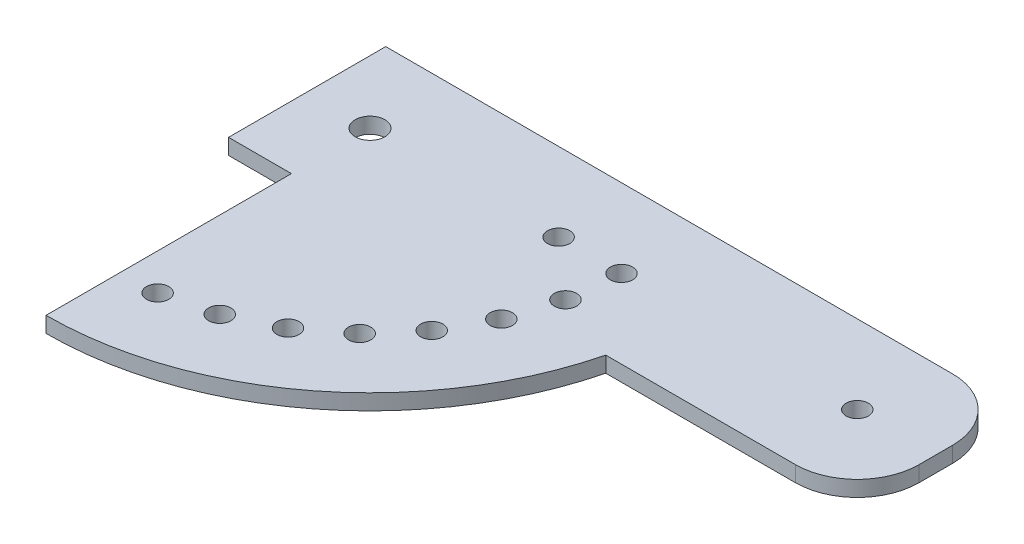
ISO-10303-21;
HEADER;
FILE_DESCRIPTION(('STEP AP214'),'2;1');
FILE_NAME('part.step','',(''),(''),'','','');
FILE_SCHEMA(('AUTOMOTIVE_DESIGN { 1 0 10303 214 1 1 1 1 }'));
ENDSEC;
DATA;
#1=APPLICATION_CONTEXT('core data for automotive mechanical design processes');
#2=APPLICATION_PROTOCOL_DEFINITION('international standard','automotive_design',2000,#1);
#3=PRODUCT_CONTEXT('',#1,'mechanical');
#4=PRODUCT('Part','Part','',(#3));
#5=PRODUCT_RELATED_PRODUCT_CATEGORY('part','',(#4));
#6=PRODUCT_DEFINITION_FORMATION('','',#4);
#7=PRODUCT_DEFINITION_CONTEXT('part definition',#1,'design');
#8=PRODUCT_DEFINITION('design','',#6,#7);
#9=PRODUCT_DEFINITION_SHAPE('','',#8);
#10=(LENGTH_UNIT() NAMED_UNIT(*) SI_UNIT(.MILLI.,.METRE.));
#11=(NAMED_UNIT(*) PLANE_ANGLE_UNIT() SI_UNIT($,.RADIAN.));
#12=(NAMED_UNIT(*) SI_UNIT($,.STERADIAN.) SOLID_ANGLE_UNIT());
#13=UNCERTAINTY_MEASURE_WITH_UNIT(LENGTH_MEASURE(1.E-05),#10,'distance_accuracy_value','');
#14=(GEOMETRIC_REPRESENTATION_CONTEXT(3) GLOBAL_UNCERTAINTY_ASSIGNED_CONTEXT((#13)) GLOBAL_UNIT_ASSIGNED_CONTEXT((#10,
#11,#12)) REPRESENTATION_CONTEXT('',''));
#15=CARTESIAN_POINT('',(0.,0.,0.));
#16=DIRECTION('',(0.,0.,1.));
#17=DIRECTION('',(1.,0.,0.));
#18=AXIS2_PLACEMENT_3D('',#15,#16,#17);
#19=CARTESIAN_POINT('',(0.,3.175,0.));
#20=DIRECTION('',(0.,-1.,0.));
#21=DIRECTION('',(0.,0.,-1.));
#22=AXIS2_PLACEMENT_3D('',#19,#20,#21);
#23=PLANE('',#22);
#24=DIRECTION('',(1.,0.,0.));
#25=VECTOR('',#24,1.);
#26=CARTESIAN_POINT('',(-12.7,3.175,15.875));
#27=LINE('',#26,#25);
#28=CARTESIAN_POINT('',(-12.7,3.175,15.875));
#29=VERTEX_POINT('',#28);
#30=CARTESIAN_POINT('',(0.,3.175,15.875));
#31=VERTEX_POINT('',#30);
#32=EDGE_CURVE('E159',#29,#31,#27,.T.);
#33=ORIENTED_EDGE('',*,*,#32,.T.);
#34=DIRECTION('',(0.,0.,1.));
#35=VECTOR('',#34,1.);
#36=CARTESIAN_POINT('',(0.,3.175,65.4543018066803));
#37=LINE('',#36,#35);
#38=CARTESIAN_POINT('',(0.,3.175,65.4543018066803));
#39=VERTEX_POINT('',#38);
#40=EDGE_CURVE('E102',#31,#39,#37,.T.);
#41=ORIENTED_EDGE('',*,*,#40,.T.);
#42=CARTESIAN_POINT('',(0.,3.175,0.));
#43=DIRECTION('',(0.,1.,0.));
#44=DIRECTION('',(0.,0.,-1.));
#45=AXIS2_PLACEMENT_3D('',#42,#43,#44);
#46=CIRCLE('',#45,65.4543018066803);
#47=CARTESIAN_POINT('',(63.5,3.175,15.875));
#48=VERTEX_POINT('',#47);
#49=EDGE_CURVE('E177',#39,#48,#46,.T.);
#50=ORIENTED_EDGE('',*,*,#49,.T.);
#51=DIRECTION('',(1.,0.,0.));
#52=VECTOR('',#51,1.);
#53=CARTESIAN_POINT('',(101.8,3.175,15.875));
#54=LINE('',#53,#52);
#55=CARTESIAN_POINT('',(101.8,3.175,15.875));
#56=VERTEX_POINT('',#55);
#57=EDGE_CURVE('E194',#48,#56,#54,.T.);
#58=ORIENTED_EDGE('',*,*,#57,.T.);
#59=CARTESIAN_POINT('',(101.8,3.175,3.375));
#60=DIRECTION('',(0.,1.,0.));
#61=DIRECTION('',(0.,0.,-1.));
#62=AXIS2_PLACEMENT_3D('',#59,#60,#61);
#63=CIRCLE('',#62,12.5);
#64=CARTESIAN_POINT('',(114.3,3.175,3.37499999999991));
#65=VERTEX_POINT('',#64);
#66=EDGE_CURVE('E193',#56,#65,#63,.T.);
#67=ORIENTED_EDGE('',*,*,#66,.T.);
#68=DIRECTION('',(0.,0.,-1.));
#69=VECTOR('',#68,1.);
#70=CARTESIAN_POINT('',(114.3,3.175,-3.37499999999991));
#71=LINE('',#70,#69);
#72=CARTESIAN_POINT('',(114.3,3.175,-3.37499999999991));
#73=VERTEX_POINT('',#72);
#74=EDGE_CURVE('E124',#65,#73,#71,.T.);
#75=ORIENTED_EDGE('',*,*,#74,.T.);
#76=CARTESIAN_POINT('',(101.8,3.175,-3.375));
#77=DIRECTION('',(0.,1.,0.));
#78=DIRECTION('',(0.,0.,-1.));
#79=AXIS2_PLACEMENT_3D('',#76,#77,#78);
#80=CIRCLE('',#79,12.5);
#81=CARTESIAN_POINT('',(101.8,3.175,-15.875));
#82=VERTEX_POINT('',#81);
#83=EDGE_CURVE('E118',#73,#82,#80,.T.);
#84=ORIENTED_EDGE('',*,*,#83,.T.);
#85=DIRECTION('',(-1.,0.,0.));
#86=VECTOR('',#85,1.);
#87=CARTESIAN_POINT('',(-12.7,3.175,-15.875));
#88=LINE('',#87,#86);
#89=CARTESIAN_POINT('',(-12.7,3.175,-15.875));
#90=VERTEX_POINT('',#89);
#91=EDGE_CURVE('E122',#82,#90,#88,.T.);
#92=ORIENTED_EDGE('',*,*,#91,.T.);
#93=DIRECTION('',(0.,0.,1.));
#94=VECTOR('',#93,1.);
#95=CARTESIAN_POINT('',(-12.7,3.175,15.875));
#96=LINE('',#95,#94);
#97=EDGE_CURVE('E56',#90,#29,#96,.T.);
#98=ORIENTED_EDGE('',*,*,#97,.T.);
#99=EDGE_LOOP('',(#33,#41,#50,#58,#67,#75,#84,#92,#98));
#100=FACE_BOUND('',#99,.T.);
#101=CARTESIAN_POINT('',(49.7504976092945,3.175,10.2726816181356));
#102=DIRECTION('',(0.,1.,0.));
#103=DIRECTION('',(0.,0.,1.));
#104=AXIS2_PLACEMENT_3D('',#101,#102,#103);
#105=CIRCLE('',#104,2.25);
#106=CARTESIAN_POINT('',(49.7504976092945,3.175,12.5226816181356));
#107=VERTEX_POINT('',#106);
#108=EDGE_CURVE('E146',#107,#107,#105,.T.);
#109=ORIENTED_EDGE('',*,*,#108,.F.);
#110=EDGE_LOOP('',(#109));
#111=FACE_BOUND('',#110,.T.);
#112=CARTESIAN_POINT('',(50.8,3.175,0.));
#113=DIRECTION('',(0.,1.,0.));
#114=DIRECTION('',(0.,0.,1.));
#115=AXIS2_PLACEMENT_3D('',#112,#113,#114);
#116=CIRCLE('',#115,2.25000000000001);
#117=CARTESIAN_POINT('',(50.8,3.175,2.25000000000001));
#118=VERTEX_POINT('',#117);
#119=EDGE_CURVE('E204',#118,#118,#116,.T.);
#120=ORIENTED_EDGE('',*,*,#119,.F.);
#121=EDGE_LOOP('',(#120));
#122=FACE_BOUND('',#121,.T.);
#123=CARTESIAN_POINT('',(0.,3.175,0.));
#124=DIRECTION('',(0.,1.,0.));
#125=DIRECTION('',(0.,0.,1.));
#126=AXIS2_PLACEMENT_3D('',#123,#124,#125);
#127=CIRCLE('',#126,3.);
#128=CARTESIAN_POINT('',(0.,3.175,3.));
#129=VERTEX_POINT('',#128);
#130=EDGE_CURVE('E210',#129,#129,#127,.T.);
#131=ORIENTED_EDGE('',*,*,#130,.F.);
#132=EDGE_LOOP('',(#131));
#133=FACE_BOUND('',#132,.T.);
#134=CARTESIAN_POINT('',(98.425,3.175,0.));
#135=DIRECTION('',(0.,1.,0.));
#136=DIRECTION('',(0.,0.,1.));
#137=AXIS2_PLACEMENT_3D('',#134,#135,#136);
#138=CIRCLE('',#137,2.25);
#139=CARTESIAN_POINT('',(98.425,3.175,2.25));
#140=VERTEX_POINT('',#139);
#141=EDGE_CURVE('E216',#140,#140,#138,.T.);
#142=ORIENTED_EDGE('',*,*,#141,.F.);
#143=EDGE_LOOP('',(#142));
#144=FACE_BOUND('',#143,.T.);
#145=CARTESIAN_POINT('',(38.1,3.175,0.));
#146=DIRECTION('',(0.,1.,0.));
#147=DIRECTION('',(0.,0.,1.));
#148=AXIS2_PLACEMENT_3D('',#145,#146,#147);
#149=CIRCLE('',#148,2.25);
#150=CARTESIAN_POINT('',(38.1,3.175,2.25));
#151=VERTEX_POINT('',#150);
#152=EDGE_CURVE('E222',#151,#151,#149,.T.);
#153=ORIENTED_EDGE('',*,*,#152,.F.);
#154=EDGE_LOOP('',(#153));
#155=FACE_BOUND('',#154,.T.);
#156=CARTESIAN_POINT('',(46.6453548178118,3.175,20.1209063891377));
#157=DIRECTION('',(0.,1.,0.));
#158=DIRECTION('',(0.,0.,1.));
#159=AXIS2_PLACEMENT_3D('',#156,#157,#158);
#160=CIRCLE('',#159,2.25);
#161=CARTESIAN_POINT('',(46.6453548178118,3.175,22.3709063891377));
#162=VERTEX_POINT('',#161);
#163=EDGE_CURVE('E228',#162,#162,#160,.T.);
#164=ORIENTED_EDGE('',*,*,#163,.F.);
#165=EDGE_LOOP('',(#164));
#166=FACE_BOUND('',#165,.T.);
#167=CARTESIAN_POINT('',(41.6128729949669,3.175,29.1377555948421));
#168=DIRECTION('',(0.,1.,0.));
#169=DIRECTION('',(0.,0.,1.));
#170=AXIS2_PLACEMENT_3D('',#167,#168,#169);
#171=CIRCLE('',#170,2.25000000000001);
#172=CARTESIAN_POINT('',(41.6128729949669,3.175,31.3877555948421));
#173=VERTEX_POINT('',#172);
#174=EDGE_CURVE('E234',#173,#173,#171,.T.);
#175=ORIENTED_EDGE('',*,*,#174,.F.);
#176=EDGE_LOOP('',(#175));
#177=FACE_BOUND('',#176,.T.);
#178=CARTESIAN_POINT('',(34.8609892157307,3.175,36.9506621172166));
#179=DIRECTION('',(0.,1.,0.));
#180=DIRECTION('',(0.,0.,1.));
#181=AXIS2_PLACEMENT_3D('',#178,#179,#180);
#182=CIRCLE('',#181,2.25);
#183=CARTESIAN_POINT('',(34.8609892157307,3.175,39.2006621172166));
#184=VERTEX_POINT('',#183);
#185=EDGE_CURVE('E240',#184,#184,#182,.T.);
#186=ORIENTED_EDGE('',*,*,#185,.F.);
#187=EDGE_LOOP('',(#186));
#188=FACE_BOUND('',#187,.T.);
#189=CARTESIAN_POINT('',(26.6686845103422,3.175,43.2368045360412));
#190=DIRECTION('',(0.,1.,0.));
#191=DIRECTION('',(0.,0.,1.));
#192=AXIS2_PLACEMENT_3D('',#189,#190,#191);
#193=CIRCLE('',#192,2.25);
#194=CARTESIAN_POINT('',(26.6686845103422,3.175,45.4868045360412));
#195=VERTEX_POINT('',#194);
#196=EDGE_CURVE('E246',#195,#195,#193,.T.);
#197=ORIENTED_EDGE('',*,*,#196,.F.);
#198=EDGE_LOOP('',(#197));
#199=FACE_BOUND('',#198,.T.);
#200=CARTESIAN_POINT('',(17.3744566494192,3.175,47.7364457845099));
#201=DIRECTION('',(0.,1.,0.));
#202=DIRECTION('',(0.,0.,1.));
#203=AXIS2_PLACEMENT_3D('',#200,#201,#202);
#204=CIRCLE('',#203,2.25);
#205=CARTESIAN_POINT('',(17.3744566494192,3.175,49.9864457845099));
#206=VERTEX_POINT('',#205);
#207=EDGE_CURVE('E252',#206,#206,#204,.T.);
#208=ORIENTED_EDGE('',*,*,#207,.F.);
#209=EDGE_LOOP('',(#208));
#210=FACE_BOUND('',#209,.T.);
#211=CARTESIAN_POINT('',(7.36233375736346,3.175,50.2636652229539));
#212=DIRECTION('',(0.,1.,0.));
#213=DIRECTION('',(0.,0.,1.));
#214=AXIS2_PLACEMENT_3D('',#211,#212,#213);
#215=CIRCLE('',#214,2.25);
#216=CARTESIAN_POINT('',(7.36233375736346,3.175,52.5136652229539));
#217=VERTEX_POINT('',#216);
#218=EDGE_CURVE('E258',#217,#217,#215,.T.);
#219=ORIENTED_EDGE('',*,*,#218,.F.);
#220=EDGE_LOOP('',(#219));
#221=FACE_BOUND('',#220,.T.);
#222=ADVANCED_FACE('F39',(#100,#111,#122,#133,#144,#155,#166,#177,#188,#199,#210,#221),#23,.F.);
#223=CARTESIAN_POINT('',(0.,0.,0.));
#224=DIRECTION('',(0.,-1.,0.));
#225=DIRECTION('',(0.,0.,-1.));
#226=AXIS2_PLACEMENT_3D('',#223,#224,#225);
#227=PLANE('',#226);
#228=CARTESIAN_POINT('',(17.3744566494192,0.,47.7364457845099));
#229=DIRECTION('',(0.,1.,0.));
#230=DIRECTION('',(0.,0.,1.));
#231=AXIS2_PLACEMENT_3D('',#228,#229,#230);
#232=CIRCLE('',#231,2.25);
#233=CARTESIAN_POINT('',(17.3744566494192,0.,49.9864457845099));
#234=VERTEX_POINT('',#233);
#235=EDGE_CURVE('E255',#234,#234,#232,.T.);
#236=ORIENTED_EDGE('',*,*,#235,.T.);
#237=EDGE_LOOP('',(#236));
#238=FACE_BOUND('',#237,.T.);
#239=CARTESIAN_POINT('',(34.8609892157307,0.,36.9506621172166));
#240=DIRECTION('',(0.,1.,0.));
#241=DIRECTION('',(0.,0.,1.));
#242=AXIS2_PLACEMENT_3D('',#239,#240,#241);
#243=CIRCLE('',#242,2.25);
#244=CARTESIAN_POINT('',(34.8609892157307,0.,39.2006621172166));
#245=VERTEX_POINT('',#244);
#246=EDGE_CURVE('E243',#245,#245,#243,.T.);
#247=ORIENTED_EDGE('',*,*,#246,.T.);
#248=EDGE_LOOP('',(#247));
#249=FACE_BOUND('',#248,.T.);
#250=CARTESIAN_POINT('',(46.6453548178118,0.,20.1209063891377));
#251=DIRECTION('',(0.,1.,0.));
#252=DIRECTION('',(0.,0.,1.));
#253=AXIS2_PLACEMENT_3D('',#250,#251,#252);
#254=CIRCLE('',#253,2.25);
#255=CARTESIAN_POINT('',(46.6453548178118,0.,22.3709063891377));
#256=VERTEX_POINT('',#255);
#257=EDGE_CURVE('E231',#256,#256,#254,.T.);
#258=ORIENTED_EDGE('',*,*,#257,.T.);
#259=EDGE_LOOP('',(#258));
#260=FACE_BOUND('',#259,.T.);
#261=CARTESIAN_POINT('',(98.425,0.,0.));
#262=DIRECTION('',(0.,1.,0.));
#263=DIRECTION('',(0.,0.,1.));
#264=AXIS2_PLACEMENT_3D('',#261,#262,#263);
#265=CIRCLE('',#264,2.25);
#266=CARTESIAN_POINT('',(98.425,0.,2.25));
#267=VERTEX_POINT('',#266);
#268=EDGE_CURVE('E219',#267,#267,#265,.T.);
#269=ORIENTED_EDGE('',*,*,#268,.T.);
#270=EDGE_LOOP('',(#269));
#271=FACE_BOUND('',#270,.T.);
#272=CARTESIAN_POINT('',(50.8,0.,0.));
#273=DIRECTION('',(0.,1.,0.));
#274=DIRECTION('',(0.,0.,1.));
#275=AXIS2_PLACEMENT_3D('',#272,#273,#274);
#276=CIRCLE('',#275,2.25000000000001);
#277=CARTESIAN_POINT('',(50.8,0.,2.25000000000001));
#278=VERTEX_POINT('',#277);
#279=EDGE_CURVE('E207',#278,#278,#276,.T.);
#280=ORIENTED_EDGE('',*,*,#279,.T.);
#281=EDGE_LOOP('',(#280));
#282=FACE_BOUND('',#281,.T.);
#283=DIRECTION('',(1.,0.,0.));
#284=VECTOR('',#283,1.);
#285=CARTESIAN_POINT('',(-12.7,0.,15.875));
#286=LINE('',#285,#284);
#287=CARTESIAN_POINT('',(-12.7,0.,15.875));
#288=VERTEX_POINT('',#287);
#289=CARTESIAN_POINT('',(0.,0.,15.875));
#290=VERTEX_POINT('',#289);
#291=EDGE_CURVE('E142',#288,#290,#286,.T.);
#292=ORIENTED_EDGE('',*,*,#291,.F.);
#293=DIRECTION('',(0.,0.,1.));
#294=VECTOR('',#293,1.);
#295=CARTESIAN_POINT('',(-12.7,0.,15.875));
#296=LINE('',#295,#294);
#297=CARTESIAN_POINT('',(-12.7,0.,-15.875));
#298=VERTEX_POINT('',#297);
#299=EDGE_CURVE('E94',#298,#288,#296,.T.);
#300=ORIENTED_EDGE('',*,*,#299,.F.);
#301=DIRECTION('',(-1.,0.,0.));
#302=VECTOR('',#301,1.);
#303=CARTESIAN_POINT('',(-12.7,0.,-15.875));
#304=LINE('',#303,#302);
#305=CARTESIAN_POINT('',(101.8,0.,-15.875));
#306=VERTEX_POINT('',#305);
#307=EDGE_CURVE('E88',#306,#298,#304,.T.);
#308=ORIENTED_EDGE('',*,*,#307,.F.);
#309=CARTESIAN_POINT('',(101.8,0.,-3.375));
#310=DIRECTION('',(0.,1.,0.));
#311=DIRECTION('',(0.,0.,-1.));
#312=AXIS2_PLACEMENT_3D('',#309,#310,#311);
#313=CIRCLE('',#312,12.5);
#314=CARTESIAN_POINT('',(114.3,0.,-3.37499999999991));
#315=VERTEX_POINT('',#314);
#316=EDGE_CURVE('E132',#315,#306,#313,.T.);
#317=ORIENTED_EDGE('',*,*,#316,.F.);
#318=DIRECTION('',(0.,0.,-1.));
#319=VECTOR('',#318,1.);
#320=CARTESIAN_POINT('',(114.3,0.,-3.37499999999991));
#321=LINE('',#320,#319);
#322=CARTESIAN_POINT('',(114.3,0.,3.37499999999991));
#323=VERTEX_POINT('',#322);
#324=EDGE_CURVE('E154',#323,#315,#321,.T.);
#325=ORIENTED_EDGE('',*,*,#324,.F.);
#326=CARTESIAN_POINT('',(101.8,0.,3.375));
#327=DIRECTION('',(0.,1.,0.));
#328=DIRECTION('',(0.,0.,-1.));
#329=AXIS2_PLACEMENT_3D('',#326,#327,#328);
#330=CIRCLE('',#329,12.5);
#331=CARTESIAN_POINT('',(101.8,0.,15.875));
#332=VERTEX_POINT('',#331);
#333=EDGE_CURVE('E152',#332,#323,#330,.T.);
#334=ORIENTED_EDGE('',*,*,#333,.F.);
#335=DIRECTION('',(1.,0.,0.));
#336=VECTOR('',#335,1.);
#337=CARTESIAN_POINT('',(101.8,0.,15.875));
#338=LINE('',#337,#336);
#339=CARTESIAN_POINT('',(63.5,0.,15.875));
#340=VERTEX_POINT('',#339);
#341=EDGE_CURVE('E150',#340,#332,#338,.T.);
#342=ORIENTED_EDGE('',*,*,#341,.F.);
#343=CARTESIAN_POINT('',(0.,0.,0.));
#344=DIRECTION('',(0.,1.,0.));
#345=DIRECTION('',(0.,0.,-1.));
#346=AXIS2_PLACEMENT_3D('',#343,#344,#345);
#347=CIRCLE('',#346,65.4543018066803);
#348=CARTESIAN_POINT('',(0.,0.,65.4543018066803));
#349=VERTEX_POINT('',#348);
#350=EDGE_CURVE('E148',#349,#340,#347,.T.);
#351=ORIENTED_EDGE('',*,*,#350,.F.);
#352=DIRECTION('',(0.,0.,1.));
#353=VECTOR('',#352,1.);
#354=CARTESIAN_POINT('',(0.,0.,65.4543018066803));
#355=LINE('',#354,#353);
#356=EDGE_CURVE('E145',#290,#349,#355,.T.);
#357=ORIENTED_EDGE('',*,*,#356,.F.);
#358=EDGE_LOOP('',(#292,#300,#308,#317,#325,#334,#342,#351,#357));
#359=FACE_BOUND('',#358,.T.);
#360=CARTESIAN_POINT('',(49.7504976092945,0.,10.2726816181356));
#361=DIRECTION('',(0.,1.,0.));
#362=DIRECTION('',(0.,0.,1.));
#363=AXIS2_PLACEMENT_3D('',#360,#361,#362);
#364=CIRCLE('',#363,2.25);
#365=CARTESIAN_POINT('',(49.7504976092945,0.,12.5226816181356));
#366=VERTEX_POINT('',#365);
#367=EDGE_CURVE('E201',#366,#366,#364,.T.);
#368=ORIENTED_EDGE('',*,*,#367,.T.);
#369=EDGE_LOOP('',(#368));
#370=FACE_BOUND('',#369,.T.);
#371=CARTESIAN_POINT('',(0.,0.,0.));
#372=DIRECTION('',(0.,1.,0.));
#373=DIRECTION('',(0.,0.,1.));
#374=AXIS2_PLACEMENT_3D('',#371,#372,#373);
#375=CIRCLE('',#374,3.);
#376=CARTESIAN_POINT('',(0.,0.,3.));
#377=VERTEX_POINT('',#376);
#378=EDGE_CURVE('E213',#377,#377,#375,.T.);
#379=ORIENTED_EDGE('',*,*,#378,.T.);
#380=EDGE_LOOP('',(#379));
#381=FACE_BOUND('',#380,.T.);
#382=CARTESIAN_POINT('',(38.1,0.,0.));
#383=DIRECTION('',(0.,1.,0.));
#384=DIRECTION('',(0.,0.,1.));
#385=AXIS2_PLACEMENT_3D('',#382,#383,#384);
#386=CIRCLE('',#385,2.25);
#387=CARTESIAN_POINT('',(38.1,0.,2.25));
#388=VERTEX_POINT('',#387);
#389=EDGE_CURVE('E225',#388,#388,#386,.T.);
#390=ORIENTED_EDGE('',*,*,#389,.T.);
#391=EDGE_LOOP('',(#390));
#392=FACE_BOUND('',#391,.T.);
#393=CARTESIAN_POINT('',(41.6128729949669,0.,29.1377555948421));
#394=DIRECTION('',(0.,1.,0.));
#395=DIRECTION('',(0.,0.,1.));
#396=AXIS2_PLACEMENT_3D('',#393,#394,#395);
#397=CIRCLE('',#396,2.25000000000001);
#398=CARTESIAN_POINT('',(41.6128729949669,0.,31.3877555948421));
#399=VERTEX_POINT('',#398);
#400=EDGE_CURVE('E237',#399,#399,#397,.T.);
#401=ORIENTED_EDGE('',*,*,#400,.T.);
#402=EDGE_LOOP('',(#401));
#403=FACE_BOUND('',#402,.T.);
#404=CARTESIAN_POINT('',(26.6686845103422,0.,43.2368045360412));
#405=DIRECTION('',(0.,1.,0.));
#406=DIRECTION('',(0.,0.,1.));
#407=AXIS2_PLACEMENT_3D('',#404,#405,#406);
#408=CIRCLE('',#407,2.25);
#409=CARTESIAN_POINT('',(26.6686845103422,0.,45.4868045360412));
#410=VERTEX_POINT('',#409);
#411=EDGE_CURVE('E249',#410,#410,#408,.T.);
#412=ORIENTED_EDGE('',*,*,#411,.T.);
#413=EDGE_LOOP('',(#412));
#414=FACE_BOUND('',#413,.T.);
#415=CARTESIAN_POINT('',(7.36233375736346,0.,50.2636652229539));
#416=DIRECTION('',(0.,1.,0.));
#417=DIRECTION('',(0.,0.,1.));
#418=AXIS2_PLACEMENT_3D('',#415,#416,#417);
#419=CIRCLE('',#418,2.25);
#420=CARTESIAN_POINT('',(7.36233375736346,0.,52.5136652229539));
#421=VERTEX_POINT('',#420);
#422=EDGE_CURVE('E261',#421,#421,#419,.T.);
#423=ORIENTED_EDGE('',*,*,#422,.T.);
#424=EDGE_LOOP('',(#423));
#425=FACE_BOUND('',#424,.T.);
#426=ADVANCED_FACE('F181',(#238,#249,#260,#271,#282,#359,#370,#381,#392,#403,#414,#425),#227,.T.);
#427=CARTESIAN_POINT('',(-12.7,3.175,15.875));
#428=DIRECTION('',(0.,0.,-1.));
#429=DIRECTION('',(-1.,0.,0.));
#430=AXIS2_PLACEMENT_3D('',#427,#428,#429);
#431=PLANE('',#430);
#432=ORIENTED_EDGE('',*,*,#291,.T.);
#433=DIRECTION('',(0.,-1.,0.));
#434=VECTOR('',#433,1.);
#435=CARTESIAN_POINT('',(0.,3.175,15.875));
#436=LINE('',#435,#434);
#437=EDGE_CURVE('E11',#31,#290,#436,.T.);
#438=ORIENTED_EDGE('',*,*,#437,.F.);
#439=ORIENTED_EDGE('',*,*,#32,.F.);
#440=DIRECTION('',(0.,-1.,0.));
#441=VECTOR('',#440,1.);
#442=CARTESIAN_POINT('',(-12.7,3.175,15.875));
#443=LINE('',#442,#441);
#444=EDGE_CURVE('E138',#29,#288,#443,.T.);
#445=ORIENTED_EDGE('',*,*,#444,.T.);
#446=EDGE_LOOP('',(#432,#438,#439,#445));
#447=FACE_BOUND('',#446,.T.);
#448=ADVANCED_FACE('F41',(#447),#431,.F.);
#449=CARTESIAN_POINT('',(0.,3.175,65.4543018066803));
#450=DIRECTION('',(1.,0.,0.));
#451=DIRECTION('',(0.,0.,-1.));
#452=AXIS2_PLACEMENT_3D('',#449,#450,#451);
#453=PLANE('',#452);
#454=ORIENTED_EDGE('',*,*,#356,.T.);
#455=DIRECTION('',(0.,-1.,0.));
#456=VECTOR('',#455,1.);
#457=CARTESIAN_POINT('',(0.,3.175,65.4543018066803));
#458=LINE('',#457,#456);
#459=EDGE_CURVE('E48',#39,#349,#458,.T.);
#460=ORIENTED_EDGE('',*,*,#459,.F.);
#461=ORIENTED_EDGE('',*,*,#40,.F.);
#462=ORIENTED_EDGE('',*,*,#437,.T.);
#463=EDGE_LOOP('',(#454,#460,#461,#462));
#464=FACE_BOUND('',#463,.T.);
#465=ADVANCED_FACE('F297',(#464),#453,.F.);
#466=CARTESIAN_POINT('',(0.,3.175,0.));
#467=DIRECTION('',(0.,-1.,0.));
#468=DIRECTION('',(0.,0.,-1.));
#469=AXIS2_PLACEMENT_3D('',#466,#467,#468);
#470=CYLINDRICAL_SURFACE('',#469,65.4543018066803);
#471=ORIENTED_EDGE('',*,*,#350,.T.);
#472=DIRECTION('',(0.,-1.,0.));
#473=VECTOR('',#472,1.);
#474=CARTESIAN_POINT('',(63.5,3.175,15.875));
#475=LINE('',#474,#473);
#476=EDGE_CURVE('E169',#48,#340,#475,.T.);
#477=ORIENTED_EDGE('',*,*,#476,.F.);
#478=ORIENTED_EDGE('',*,*,#49,.F.);
#479=ORIENTED_EDGE('',*,*,#459,.T.);
#480=EDGE_LOOP('',(#471,#477,#478,#479));
#481=FACE_BOUND('',#480,.T.);
#482=ADVANCED_FACE('F175',(#481),#470,.T.);
#483=CARTESIAN_POINT('',(101.8,3.175,15.875));
#484=DIRECTION('',(0.,0.,-1.));
#485=DIRECTION('',(-1.,0.,0.));
#486=AXIS2_PLACEMENT_3D('',#483,#484,#485);
#487=PLANE('',#486);
#488=ORIENTED_EDGE('',*,*,#341,.T.);
#489=DIRECTION('',(0.,-1.,0.));
#490=VECTOR('',#489,1.);
#491=CARTESIAN_POINT('',(101.8,3.175,15.875));
#492=LINE('',#491,#490);
#493=EDGE_CURVE('E166',#56,#332,#492,.T.);
#494=ORIENTED_EDGE('',*,*,#493,.F.);
#495=ORIENTED_EDGE('',*,*,#57,.F.);
#496=ORIENTED_EDGE('',*,*,#476,.T.);
#497=EDGE_LOOP('',(#488,#494,#495,#496));
#498=FACE_BOUND('',#497,.T.);
#499=ADVANCED_FACE('F187',(#498),#487,.F.);
#500=CARTESIAN_POINT('',(101.8,3.175,3.375));
#501=DIRECTION('',(0.,-1.,0.));
#502=DIRECTION('',(0.,0.,-1.));
#503=AXIS2_PLACEMENT_3D('',#500,#501,#502);
#504=CYLINDRICAL_SURFACE('',#503,12.5);
#505=ORIENTED_EDGE('',*,*,#333,.T.);
#506=DIRECTION('',(0.,-1.,0.));
#507=VECTOR('',#506,1.);
#508=CARTESIAN_POINT('',(114.3,3.175,3.37499999999991));
#509=LINE('',#508,#507);
#510=EDGE_CURVE('E163',#65,#323,#509,.T.);
#511=ORIENTED_EDGE('',*,*,#510,.F.);
#512=ORIENTED_EDGE('',*,*,#66,.F.);
#513=ORIENTED_EDGE('',*,*,#493,.T.);
#514=EDGE_LOOP('',(#505,#511,#512,#513));
#515=FACE_BOUND('',#514,.T.);
#516=ADVANCED_FACE('F191',(#515),#504,.T.);
#517=CARTESIAN_POINT('',(114.3,3.175,-3.37499999999991));
#518=DIRECTION('',(-1.,0.,0.));
#519=DIRECTION('',(0.,0.,1.));
#520=AXIS2_PLACEMENT_3D('',#517,#518,#519);
#521=PLANE('',#520);
#522=ORIENTED_EDGE('',*,*,#324,.T.);
#523=DIRECTION('',(0.,-1.,0.));
#524=VECTOR('',#523,1.);
#525=CARTESIAN_POINT('',(114.3,3.175,-3.37499999999991));
#526=LINE('',#525,#524);
#527=EDGE_CURVE('E133',#73,#315,#526,.T.);
#528=ORIENTED_EDGE('',*,*,#527,.F.);
#529=ORIENTED_EDGE('',*,*,#74,.F.);
#530=ORIENTED_EDGE('',*,*,#510,.T.);
#531=EDGE_LOOP('',(#522,#528,#529,#530));
#532=FACE_BOUND('',#531,.T.);
#533=ADVANCED_FACE('F288',(#532),#521,.F.);
#534=CARTESIAN_POINT('',(101.8,3.175,-3.375));
#535=DIRECTION('',(0.,-1.,0.));
#536=DIRECTION('',(0.,0.,-1.));
#537=AXIS2_PLACEMENT_3D('',#534,#535,#536);
#538=CYLINDRICAL_SURFACE('',#537,12.5);
#539=ORIENTED_EDGE('',*,*,#316,.T.);
#540=DIRECTION('',(0.,-1.,0.));
#541=VECTOR('',#540,1.);
#542=CARTESIAN_POINT('',(101.8,3.175,-15.875));
#543=LINE('',#542,#541);
#544=EDGE_CURVE('E129',#82,#306,#543,.T.);
#545=ORIENTED_EDGE('',*,*,#544,.F.);
#546=ORIENTED_EDGE('',*,*,#83,.F.);
#547=ORIENTED_EDGE('',*,*,#527,.T.);
#548=EDGE_LOOP('',(#539,#545,#546,#547));
#549=FACE_BOUND('',#548,.T.);
#550=ADVANCED_FACE('F130',(#549),#538,.T.);
#551=CARTESIAN_POINT('',(-12.7,3.175,-15.875));
#552=DIRECTION('',(0.,0.,1.));
#553=DIRECTION('',(1.,0.,0.));
#554=AXIS2_PLACEMENT_3D('',#551,#552,#553);
#555=PLANE('',#554);
#556=ORIENTED_EDGE('',*,*,#307,.T.);
#557=DIRECTION('',(0.,-1.,0.));
#558=VECTOR('',#557,1.);
#559=CARTESIAN_POINT('',(-12.7,3.175,-15.875));
#560=LINE('',#559,#558);
#561=EDGE_CURVE('E134',#90,#298,#560,.T.);
#562=ORIENTED_EDGE('',*,*,#561,.F.);
#563=ORIENTED_EDGE('',*,*,#91,.F.);
#564=ORIENTED_EDGE('',*,*,#544,.T.);
#565=EDGE_LOOP('',(#556,#562,#563,#564));
#566=FACE_BOUND('',#565,.T.);
#567=ADVANCED_FACE('F136',(#566),#555,.F.);
#568=CARTESIAN_POINT('',(-12.7,3.175,15.875));
#569=DIRECTION('',(1.,0.,0.));
#570=DIRECTION('',(0.,0.,-1.));
#571=AXIS2_PLACEMENT_3D('',#568,#569,#570);
#572=PLANE('',#571);
#573=ORIENTED_EDGE('',*,*,#299,.T.);
#574=ORIENTED_EDGE('',*,*,#444,.F.);
#575=ORIENTED_EDGE('',*,*,#97,.F.);
#576=ORIENTED_EDGE('',*,*,#561,.T.);
#577=EDGE_LOOP('',(#573,#574,#575,#576));
#578=FACE_BOUND('',#577,.T.);
#579=ADVANCED_FACE('F281',(#578),#572,.F.);
#580=CARTESIAN_POINT('',(49.7504976092945,3.175,10.2726816181356));
#581=DIRECTION('',(0.,-1.,0.));
#582=DIRECTION('',(0.,0.,-1.));
#583=AXIS2_PLACEMENT_3D('',#580,#581,#582);
#584=CYLINDRICAL_SURFACE('',#583,2.25);
#585=ORIENTED_EDGE('',*,*,#108,.T.);
#586=EDGE_LOOP('',(#585));
#587=FACE_BOUND('',#586,.T.);
#588=ORIENTED_EDGE('',*,*,#367,.F.);
#589=EDGE_LOOP('',(#588));
#590=FACE_BOUND('',#589,.T.);
#591=ADVANCED_FACE('F278',(#587,#590),#584,.F.);
#592=CARTESIAN_POINT('',(50.8,3.175,0.));
#593=DIRECTION('',(0.,-1.,0.));
#594=DIRECTION('',(0.,0.,-1.));
#595=AXIS2_PLACEMENT_3D('',#592,#593,#594);
#596=CYLINDRICAL_SURFACE('',#595,2.25000000000001);
#597=ORIENTED_EDGE('',*,*,#119,.T.);
#598=EDGE_LOOP('',(#597));
#599=FACE_BOUND('',#598,.T.);
#600=ORIENTED_EDGE('',*,*,#279,.F.);
#601=EDGE_LOOP('',(#600));
#602=FACE_BOUND('',#601,.T.);
#603=ADVANCED_FACE('F365',(#599,#602),#596,.F.);
#604=CARTESIAN_POINT('',(0.,3.175,0.));
#605=DIRECTION('',(0.,-1.,0.));
#606=DIRECTION('',(0.,0.,-1.));
#607=AXIS2_PLACEMENT_3D('',#604,#605,#606);
#608=CYLINDRICAL_SURFACE('',#607,3.);
#609=ORIENTED_EDGE('',*,*,#130,.T.);
#610=EDGE_LOOP('',(#609));
#611=FACE_BOUND('',#610,.T.);
#612=ORIENTED_EDGE('',*,*,#378,.F.);
#613=EDGE_LOOP('',(#612));
#614=FACE_BOUND('',#613,.T.);
#615=ADVANCED_FACE('F373',(#611,#614),#608,.F.);
#616=CARTESIAN_POINT('',(98.425,3.175,0.));
#617=DIRECTION('',(0.,-1.,0.));
#618=DIRECTION('',(0.,0.,-1.));
#619=AXIS2_PLACEMENT_3D('',#616,#617,#618);
#620=CYLINDRICAL_SURFACE('',#619,2.25);
#621=ORIENTED_EDGE('',*,*,#141,.T.);
#622=EDGE_LOOP('',(#621));
#623=FACE_BOUND('',#622,.T.);
#624=ORIENTED_EDGE('',*,*,#268,.F.);
#625=EDGE_LOOP('',(#624));
#626=FACE_BOUND('',#625,.T.);
#627=ADVANCED_FACE('F381',(#623,#626),#620,.F.);
#628=CARTESIAN_POINT('',(38.1,3.175,0.));
#629=DIRECTION('',(0.,-1.,0.));
#630=DIRECTION('',(0.,0.,-1.));
#631=AXIS2_PLACEMENT_3D('',#628,#629,#630);
#632=CYLINDRICAL_SURFACE('',#631,2.25);
#633=ORIENTED_EDGE('',*,*,#152,.T.);
#634=EDGE_LOOP('',(#633));
#635=FACE_BOUND('',#634,.T.);
#636=ORIENTED_EDGE('',*,*,#389,.F.);
#637=EDGE_LOOP('',(#636));
#638=FACE_BOUND('',#637,.T.);
#639=ADVANCED_FACE('F390',(#635,#638),#632,.F.);
#640=CARTESIAN_POINT('',(46.6453548178118,3.175,20.1209063891377));
#641=DIRECTION('',(0.,-1.,0.));
#642=DIRECTION('',(0.,0.,-1.));
#643=AXIS2_PLACEMENT_3D('',#640,#641,#642);
#644=CYLINDRICAL_SURFACE('',#643,2.25);
#645=ORIENTED_EDGE('',*,*,#163,.T.);
#646=EDGE_LOOP('',(#645));
#647=FACE_BOUND('',#646,.T.);
#648=ORIENTED_EDGE('',*,*,#257,.F.);
#649=EDGE_LOOP('',(#648));
#650=FACE_BOUND('',#649,.T.);
#651=ADVANCED_FACE('F399',(#647,#650),#644,.F.);
#652=CARTESIAN_POINT('',(41.6128729949669,3.175,29.1377555948421));
#653=DIRECTION('',(0.,-1.,0.));
#654=DIRECTION('',(0.,0.,-1.));
#655=AXIS2_PLACEMENT_3D('',#652,#653,#654);
#656=CYLINDRICAL_SURFACE('',#655,2.25000000000001);
#657=ORIENTED_EDGE('',*,*,#174,.T.);
#658=EDGE_LOOP('',(#657));
#659=FACE_BOUND('',#658,.T.);
#660=ORIENTED_EDGE('',*,*,#400,.F.);
#661=EDGE_LOOP('',(#660));
#662=FACE_BOUND('',#661,.T.);
#663=ADVANCED_FACE('F408',(#659,#662),#656,.F.);
#664=CARTESIAN_POINT('',(34.8609892157307,3.175,36.9506621172166));
#665=DIRECTION('',(0.,-1.,0.));
#666=DIRECTION('',(0.,0.,-1.));
#667=AXIS2_PLACEMENT_3D('',#664,#665,#666);
#668=CYLINDRICAL_SURFACE('',#667,2.25);
#669=ORIENTED_EDGE('',*,*,#185,.T.);
#670=EDGE_LOOP('',(#669));
#671=FACE_BOUND('',#670,.T.);
#672=ORIENTED_EDGE('',*,*,#246,.F.);
#673=EDGE_LOOP('',(#672));
#674=FACE_BOUND('',#673,.T.);
#675=ADVANCED_FACE('F417',(#671,#674),#668,.F.);
#676=CARTESIAN_POINT('',(26.6686845103422,3.175,43.2368045360412));
#677=DIRECTION('',(0.,-1.,0.));
#678=DIRECTION('',(0.,0.,-1.));
#679=AXIS2_PLACEMENT_3D('',#676,#677,#678);
#680=CYLINDRICAL_SURFACE('',#679,2.25);
#681=ORIENTED_EDGE('',*,*,#196,.T.);
#682=EDGE_LOOP('',(#681));
#683=FACE_BOUND('',#682,.T.);
#684=ORIENTED_EDGE('',*,*,#411,.F.);
#685=EDGE_LOOP('',(#684));
#686=FACE_BOUND('',#685,.T.);
#687=ADVANCED_FACE('F426',(#683,#686),#680,.F.);
#688=CARTESIAN_POINT('',(17.3744566494192,3.175,47.7364457845099));
#689=DIRECTION('',(0.,-1.,0.));
#690=DIRECTION('',(0.,0.,-1.));
#691=AXIS2_PLACEMENT_3D('',#688,#689,#690);
#692=CYLINDRICAL_SURFACE('',#691,2.25);
#693=ORIENTED_EDGE('',*,*,#207,.T.);
#694=EDGE_LOOP('',(#693));
#695=FACE_BOUND('',#694,.T.);
#696=ORIENTED_EDGE('',*,*,#235,.F.);
#697=EDGE_LOOP('',(#696));
#698=FACE_BOUND('',#697,.T.);
#699=ADVANCED_FACE('F435',(#695,#698),#692,.F.);
#700=CARTESIAN_POINT('',(7.36233375736346,3.175,50.2636652229539));
#701=DIRECTION('',(0.,-1.,0.));
#702=DIRECTION('',(0.,0.,-1.));
#703=AXIS2_PLACEMENT_3D('',#700,#701,#702);
#704=CYLINDRICAL_SURFACE('',#703,2.25);
#705=ORIENTED_EDGE('',*,*,#218,.T.);
#706=EDGE_LOOP('',(#705));
#707=FACE_BOUND('',#706,.T.);
#708=ORIENTED_EDGE('',*,*,#422,.F.);
#709=EDGE_LOOP('',(#708));
#710=FACE_BOUND('',#709,.T.);
#711=ADVANCED_FACE('F267',(#707,#710),#704,.F.);
#712=CLOSED_SHELL('',(#222,#426,#448,#465,#482,#499,#516,#533,#550,#567,#579,#591,#603,#615,
#627,#639,#651,#663,#675,#687,#699,#711));
#713=MANIFOLD_SOLID_BREP('B2',#712);
#714=ADVANCED_BREP_SHAPE_REPRESENTATION('',(#18,#713),#14);
#715=SHAPE_DEFINITION_REPRESENTATION(#9,#714);
ENDSEC;
END-ISO-10303-21;
